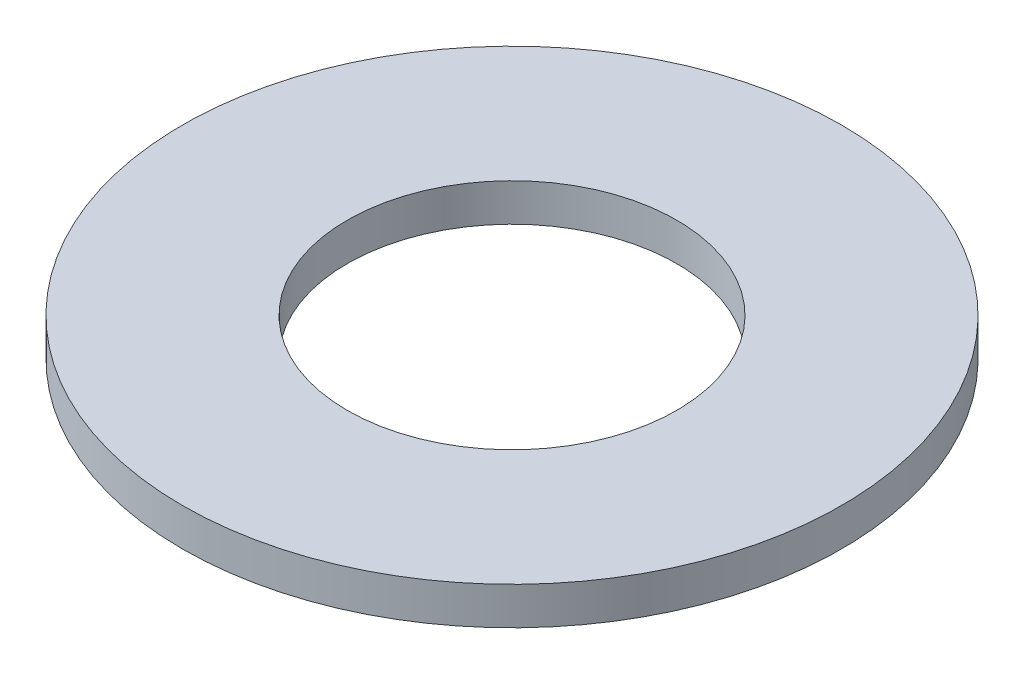
ISO-10303-21;
HEADER;
FILE_DESCRIPTION(('STEP AP214'),'2;1');
FILE_NAME('part.step','',(''),(''),'','','');
FILE_SCHEMA(('AUTOMOTIVE_DESIGN { 1 0 10303 214 1 1 1 1 }'));
ENDSEC;
DATA;
#1=APPLICATION_CONTEXT('core data for automotive mechanical design processes');
#2=APPLICATION_PROTOCOL_DEFINITION('international standard','automotive_design',2000,#1);
#3=PRODUCT_CONTEXT('',#1,'mechanical');
#4=PRODUCT('Part','Part','',(#3));
#5=PRODUCT_RELATED_PRODUCT_CATEGORY('part','',(#4));
#6=PRODUCT_DEFINITION_FORMATION('','',#4);
#7=PRODUCT_DEFINITION_CONTEXT('part definition',#1,'design');
#8=PRODUCT_DEFINITION('design','',#6,#7);
#9=PRODUCT_DEFINITION_SHAPE('','',#8);
#10=(LENGTH_UNIT() NAMED_UNIT(*) SI_UNIT(.MILLI.,.METRE.));
#11=(NAMED_UNIT(*) PLANE_ANGLE_UNIT() SI_UNIT($,.RADIAN.));
#12=(NAMED_UNIT(*) SI_UNIT($,.STERADIAN.) SOLID_ANGLE_UNIT());
#13=UNCERTAINTY_MEASURE_WITH_UNIT(LENGTH_MEASURE(1.E-05),#10,'distance_accuracy_value','');
#14=(GEOMETRIC_REPRESENTATION_CONTEXT(3) GLOBAL_UNCERTAINTY_ASSIGNED_CONTEXT((#13)) GLOBAL_UNIT_ASSIGNED_CONTEXT((#10,
#11,#12)) REPRESENTATION_CONTEXT('',''));
#15=CARTESIAN_POINT('',(0.,0.,0.));
#16=DIRECTION('',(0.,0.,1.));
#17=DIRECTION('',(1.,0.,0.));
#18=AXIS2_PLACEMENT_3D('',#15,#16,#17);
#19=CARTESIAN_POINT('',(0.,4.,0.));
#20=DIRECTION('',(0.,-1.,0.));
#21=DIRECTION('',(0.,0.,-1.));
#22=AXIS2_PLACEMENT_3D('',#19,#20,#21);
#23=CYLINDRICAL_SURFACE('',#22,35.);
#24=CARTESIAN_POINT('',(0.,4.,0.));
#25=DIRECTION('',(0.,1.,0.));
#26=DIRECTION('',(0.,0.,1.));
#27=AXIS2_PLACEMENT_3D('',#24,#25,#26);
#28=CIRCLE('',#27,35.);
#29=CARTESIAN_POINT('',(0.,4.,35.));
#30=VERTEX_POINT('',#29);
#31=EDGE_CURVE('E10',#30,#30,#28,.T.);
#32=ORIENTED_EDGE('',*,*,#31,.F.);
#33=EDGE_LOOP('',(#32));
#34=FACE_BOUND('',#33,.T.);
#35=CARTESIAN_POINT('',(0.,0.,0.));
#36=DIRECTION('',(0.,1.,0.));
#37=DIRECTION('',(0.,0.,1.));
#38=AXIS2_PLACEMENT_3D('',#35,#36,#37);
#39=CIRCLE('',#38,35.);
#40=CARTESIAN_POINT('',(0.,0.,35.));
#41=VERTEX_POINT('',#40);
#42=EDGE_CURVE('E37',#41,#41,#39,.T.);
#43=ORIENTED_EDGE('',*,*,#42,.T.);
#44=EDGE_LOOP('',(#43));
#45=FACE_BOUND('',#44,.T.);
#46=ADVANCED_FACE('F40',(#34,#45),#23,.T.);
#47=CARTESIAN_POINT('',(0.,4.,0.));
#48=DIRECTION('',(0.,1.,0.));
#49=DIRECTION('',(0.,0.,1.));
#50=AXIS2_PLACEMENT_3D('',#47,#48,#49);
#51=PLANE('',#50);
#52=CARTESIAN_POINT('',(0.,4.,0.));
#53=DIRECTION('',(0.,1.,0.));
#54=DIRECTION('',(0.,0.,1.));
#55=AXIS2_PLACEMENT_3D('',#52,#53,#54);
#56=CIRCLE('',#55,17.5);
#57=CARTESIAN_POINT('',(0.,4.,17.5));
#58=VERTEX_POINT('',#57);
#59=EDGE_CURVE('E50',#58,#58,#56,.T.);
#60=ORIENTED_EDGE('',*,*,#59,.F.);
#61=EDGE_LOOP('',(#60));
#62=FACE_BOUND('',#61,.T.);
#63=ORIENTED_EDGE('',*,*,#31,.T.);
#64=EDGE_LOOP('',(#63));
#65=FACE_BOUND('',#64,.T.);
#66=ADVANCED_FACE('F59',(#62,#65),#51,.T.);
#67=CARTESIAN_POINT('',(0.,0.,0.));
#68=DIRECTION('',(0.,1.,0.));
#69=DIRECTION('',(0.,0.,1.));
#70=AXIS2_PLACEMENT_3D('',#67,#68,#69);
#71=PLANE('',#70);
#72=CARTESIAN_POINT('',(0.,0.,0.));
#73=DIRECTION('',(0.,1.,0.));
#74=DIRECTION('',(0.,0.,1.));
#75=AXIS2_PLACEMENT_3D('',#72,#73,#74);
#76=CIRCLE('',#75,17.5);
#77=CARTESIAN_POINT('',(0.,0.,17.5));
#78=VERTEX_POINT('',#77);
#79=EDGE_CURVE('E47',#78,#78,#76,.T.);
#80=ORIENTED_EDGE('',*,*,#79,.T.);
#81=EDGE_LOOP('',(#80));
#82=FACE_BOUND('',#81,.T.);
#83=ORIENTED_EDGE('',*,*,#42,.F.);
#84=EDGE_LOOP('',(#83));
#85=FACE_BOUND('',#84,.T.);
#86=ADVANCED_FACE('F58',(#82,#85),#71,.F.);
#87=CARTESIAN_POINT('',(0.,4.,0.));
#88=DIRECTION('',(0.,-1.,0.));
#89=DIRECTION('',(0.,0.,-1.));
#90=AXIS2_PLACEMENT_3D('',#87,#88,#89);
#91=CYLINDRICAL_SURFACE('',#90,17.5);
#92=ORIENTED_EDGE('',*,*,#59,.T.);
#93=EDGE_LOOP('',(#92));
#94=FACE_BOUND('',#93,.T.);
#95=ORIENTED_EDGE('',*,*,#79,.F.);
#96=EDGE_LOOP('',(#95));
#97=FACE_BOUND('',#96,.T.);
#98=ADVANCED_FACE('F54',(#94,#97),#91,.F.);
#99=CLOSED_SHELL('',(#46,#66,#86,#98));
#100=MANIFOLD_SOLID_BREP('B2',#99);
#101=ADVANCED_BREP_SHAPE_REPRESENTATION('',(#18,#100),#14);
#102=SHAPE_DEFINITION_REPRESENTATION(#9,#101);
ENDSEC;
END-ISO-10303-21;
